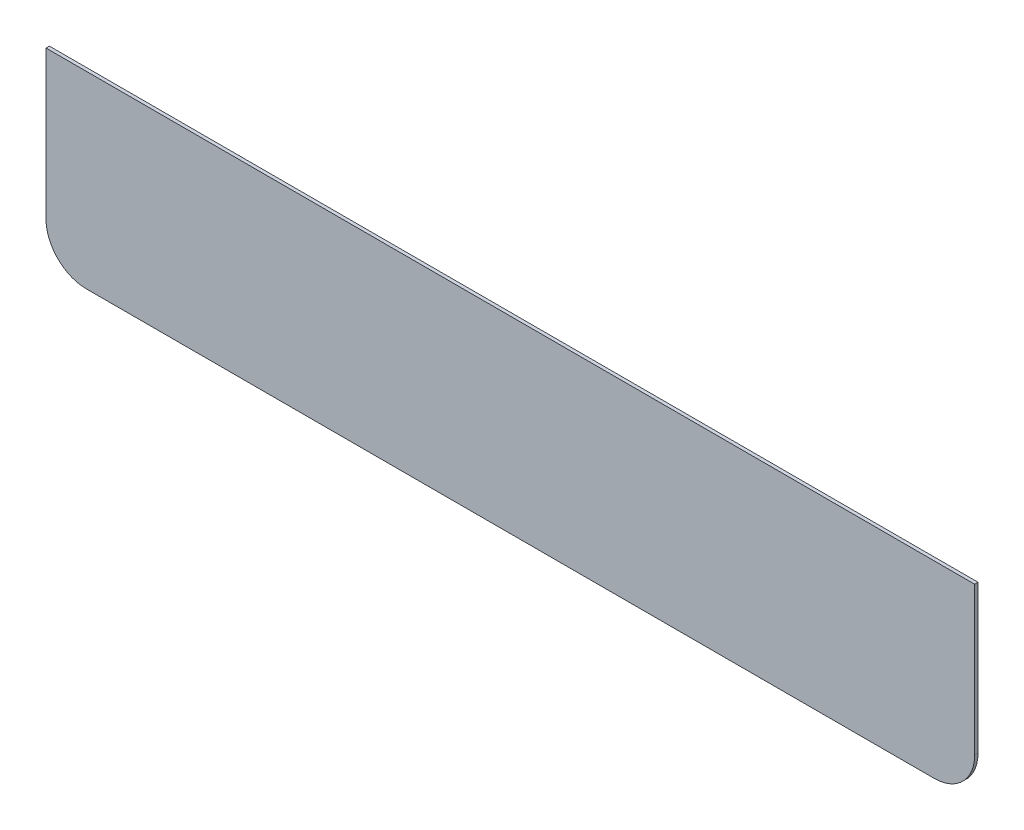
ISO-10303-21;
HEADER;
FILE_DESCRIPTION(('STEP AP214'),'2;1');
FILE_NAME('part.step','',(''),(''),'','','');
FILE_SCHEMA(('AUTOMOTIVE_DESIGN { 1 0 10303 214 1 1 1 1 }'));
ENDSEC;
DATA;
#1=APPLICATION_CONTEXT('core data for automotive mechanical design processes');
#2=APPLICATION_PROTOCOL_DEFINITION('international standard','automotive_design',2000,#1);
#3=PRODUCT_CONTEXT('',#1,'mechanical');
#4=PRODUCT('Part','Part','',(#3));
#5=PRODUCT_RELATED_PRODUCT_CATEGORY('part','',(#4));
#6=PRODUCT_DEFINITION_FORMATION('','',#4);
#7=PRODUCT_DEFINITION_CONTEXT('part definition',#1,'design');
#8=PRODUCT_DEFINITION('design','',#6,#7);
#9=PRODUCT_DEFINITION_SHAPE('','',#8);
#10=(LENGTH_UNIT() NAMED_UNIT(*) SI_UNIT(.MILLI.,.METRE.));
#11=(NAMED_UNIT(*) PLANE_ANGLE_UNIT() SI_UNIT($,.RADIAN.));
#12=(NAMED_UNIT(*) SI_UNIT($,.STERADIAN.) SOLID_ANGLE_UNIT());
#13=UNCERTAINTY_MEASURE_WITH_UNIT(LENGTH_MEASURE(1.E-05),#10,'distance_accuracy_value','');
#14=(GEOMETRIC_REPRESENTATION_CONTEXT(3) GLOBAL_UNCERTAINTY_ASSIGNED_CONTEXT((#13)) GLOBAL_UNIT_ASSIGNED_CONTEXT((#10,
#11,#12)) REPRESENTATION_CONTEXT('',''));
#15=CARTESIAN_POINT('',(0.,0.,0.));
#16=DIRECTION('',(0.,0.,1.));
#17=DIRECTION('',(1.,0.,0.));
#18=AXIS2_PLACEMENT_3D('',#15,#16,#17);
#19=CARTESIAN_POINT('',(839.453595320295,-154.88744171433,6.35));
#20=DIRECTION('',(0.,0.,1.));
#21=DIRECTION('',(1.,0.,0.));
#22=AXIS2_PLACEMENT_3D('',#19,#20,#21);
#23=PLANE('',#22);
#24=DIRECTION('',(0.,1.,0.));
#25=VECTOR('',#24,1.);
#26=CARTESIAN_POINT('',(-36.8464046797039,-259.54705830244,6.35));
#27=LINE('',#26,#25);
#28=CARTESIAN_POINT('',(-36.8464046797039,-259.54705830244,6.35));
#29=VERTEX_POINT('',#28);
#30=CARTESIAN_POINT('',(-36.8464046797039,19.8529416975601,6.35));
#31=VERTEX_POINT('',#30);
#32=EDGE_CURVE('E69',#29,#31,#27,.T.);
#33=ORIENTED_EDGE('',*,*,#32,.F.);
#34=CARTESIAN_POINT('',(39.3535953202961,-259.54705830244,6.35));
#35=DIRECTION('',(0.,0.,1.));
#36=DIRECTION('',(1.,0.,0.));
#37=AXIS2_PLACEMENT_3D('',#34,#35,#36);
#38=CIRCLE('',#37,76.2);
#39=CARTESIAN_POINT('',(39.3535953202961,-335.74705830244,6.35));
#40=VERTEX_POINT('',#39);
#41=EDGE_CURVE('E20',#40,#29,#38,.F.);
#42=ORIENTED_EDGE('',*,*,#41,.F.);
#43=DIRECTION('',(1.,0.,0.));
#44=VECTOR('',#43,1.);
#45=CARTESIAN_POINT('',(1639.55359532029,-335.74705830244,6.35));
#46=LINE('',#45,#44);
#47=CARTESIAN_POINT('',(1639.55359532029,-335.74705830244,6.35));
#48=VERTEX_POINT('',#47);
#49=EDGE_CURVE('E58',#48,#40,#46,.F.);
#50=ORIENTED_EDGE('',*,*,#49,.F.);
#51=CARTESIAN_POINT('',(1639.55359532029,-259.54705830244,6.35));
#52=DIRECTION('',(0.,0.,1.));
#53=DIRECTION('',(1.,0.,0.));
#54=AXIS2_PLACEMENT_3D('',#51,#52,#53);
#55=CIRCLE('',#54,76.2000000000002);
#56=CARTESIAN_POINT('',(1715.7535953203,-259.54705830244,6.35));
#57=VERTEX_POINT('',#56);
#58=EDGE_CURVE('E151',#57,#48,#55,.F.);
#59=ORIENTED_EDGE('',*,*,#58,.F.);
#60=DIRECTION('',(0.,1.,0.));
#61=VECTOR('',#60,1.);
#62=CARTESIAN_POINT('',(1715.7535953203,19.8529416975601,6.35));
#63=LINE('',#62,#61);
#64=CARTESIAN_POINT('',(1715.7535953203,19.8529416975601,6.35));
#65=VERTEX_POINT('',#64);
#66=EDGE_CURVE('E95',#65,#57,#63,.F.);
#67=ORIENTED_EDGE('',*,*,#66,.F.);
#68=DIRECTION('',(1.,0.,0.));
#69=VECTOR('',#68,1.);
#70=CARTESIAN_POINT('',(-36.8464046797039,19.8529416975601,6.35));
#71=LINE('',#70,#69);
#72=EDGE_CURVE('E93',#31,#65,#71,.T.);
#73=ORIENTED_EDGE('',*,*,#72,.F.);
#74=EDGE_LOOP('',(#33,#42,#50,#59,#67,#73));
#75=FACE_BOUND('',#74,.T.);
#76=ADVANCED_FACE('F17',(#75),#23,.T.);
#77=CARTESIAN_POINT('',(-36.8464046797039,19.8529416975601,0.));
#78=DIRECTION('',(0.,1.,0.));
#79=DIRECTION('',(0.,0.,1.));
#80=AXIS2_PLACEMENT_3D('',#77,#78,#79);
#81=PLANE('',#80);
#82=ORIENTED_EDGE('',*,*,#72,.T.);
#83=DIRECTION('',(0.,0.,-1.));
#84=VECTOR('',#83,1.);
#85=CARTESIAN_POINT('',(1715.7535953203,19.8529416975601,0.));
#86=LINE('',#85,#84);
#87=CARTESIAN_POINT('',(1715.7535953203,19.8529416975601,0.));
#88=VERTEX_POINT('',#87);
#89=EDGE_CURVE('E91',#88,#65,#86,.F.);
#90=ORIENTED_EDGE('',*,*,#89,.F.);
#91=DIRECTION('',(1.,0.,0.));
#92=VECTOR('',#91,1.);
#93=CARTESIAN_POINT('',(839.453595320295,19.8529416975601,0.));
#94=LINE('',#93,#92);
#95=CARTESIAN_POINT('',(-36.8464046797039,19.8529416975601,0.));
#96=VERTEX_POINT('',#95);
#97=EDGE_CURVE('E79',#88,#96,#94,.F.);
#98=ORIENTED_EDGE('',*,*,#97,.T.);
#99=DIRECTION('',(0.,0.,1.));
#100=VECTOR('',#99,1.);
#101=CARTESIAN_POINT('',(-36.8464046797039,19.8529416975601,0.));
#102=LINE('',#101,#100);
#103=EDGE_CURVE('E127',#31,#96,#102,.F.);
#104=ORIENTED_EDGE('',*,*,#103,.F.);
#105=EDGE_LOOP('',(#82,#90,#98,#104));
#106=FACE_BOUND('',#105,.T.);
#107=ADVANCED_FACE('F92',(#106),#81,.T.);
#108=CARTESIAN_POINT('',(-36.8464046797039,-259.54705830244,0.));
#109=DIRECTION('',(-1.,0.,0.));
#110=DIRECTION('',(0.,0.,1.));
#111=AXIS2_PLACEMENT_3D('',#108,#109,#110);
#112=PLANE('',#111);
#113=ORIENTED_EDGE('',*,*,#32,.T.);
#114=ORIENTED_EDGE('',*,*,#103,.T.);
#115=DIRECTION('',(0.,1.,0.));
#116=VECTOR('',#115,1.);
#117=CARTESIAN_POINT('',(-36.8464046797039,-154.88744171433,0.));
#118=LINE('',#117,#116);
#119=CARTESIAN_POINT('',(-36.8464046797039,-259.54705830244,0.));
#120=VERTEX_POINT('',#119);
#121=EDGE_CURVE('E86',#96,#120,#118,.F.);
#122=ORIENTED_EDGE('',*,*,#121,.T.);
#123=DIRECTION('',(0.,0.,1.));
#124=VECTOR('',#123,1.);
#125=CARTESIAN_POINT('',(-36.8464046797039,-259.54705830244,0.));
#126=LINE('',#125,#124);
#127=EDGE_CURVE('E129',#29,#120,#126,.F.);
#128=ORIENTED_EDGE('',*,*,#127,.F.);
#129=EDGE_LOOP('',(#113,#114,#122,#128));
#130=FACE_BOUND('',#129,.T.);
#131=ADVANCED_FACE('F118',(#130),#112,.T.);
#132=CARTESIAN_POINT('',(39.3535953202961,-259.54705830244,0.));
#133=DIRECTION('',(0.,0.,1.));
#134=DIRECTION('',(1.,0.,0.));
#135=AXIS2_PLACEMENT_3D('',#132,#133,#134);
#136=CYLINDRICAL_SURFACE('',#135,76.2);
#137=ORIENTED_EDGE('',*,*,#41,.T.);
#138=ORIENTED_EDGE('',*,*,#127,.T.);
#139=CARTESIAN_POINT('',(39.3535953202961,-259.54705830244,0.));
#140=DIRECTION('',(0.,0.,1.));
#141=DIRECTION('',(1.,0.,0.));
#142=AXIS2_PLACEMENT_3D('',#139,#140,#141);
#143=CIRCLE('',#142,76.2);
#144=CARTESIAN_POINT('',(39.3535953202961,-335.74705830244,0.));
#145=VERTEX_POINT('',#144);
#146=EDGE_CURVE('E150',#120,#145,#143,.T.);
#147=ORIENTED_EDGE('',*,*,#146,.T.);
#148=DIRECTION('',(0.,0.,-1.));
#149=VECTOR('',#148,1.);
#150=CARTESIAN_POINT('',(39.3535953202961,-335.74705830244,0.));
#151=LINE('',#150,#149);
#152=EDGE_CURVE('E132',#40,#145,#151,.T.);
#153=ORIENTED_EDGE('',*,*,#152,.F.);
#154=EDGE_LOOP('',(#137,#138,#147,#153));
#155=FACE_BOUND('',#154,.T.);
#156=ADVANCED_FACE('F115',(#155),#136,.T.);
#157=CARTESIAN_POINT('',(1639.55359532029,-335.74705830244,0.));
#158=DIRECTION('',(0.,-1.,0.));
#159=DIRECTION('',(0.,0.,-1.));
#160=AXIS2_PLACEMENT_3D('',#157,#158,#159);
#161=PLANE('',#160);
#162=ORIENTED_EDGE('',*,*,#49,.T.);
#163=ORIENTED_EDGE('',*,*,#152,.T.);
#164=DIRECTION('',(1.,0.,0.));
#165=VECTOR('',#164,1.);
#166=CARTESIAN_POINT('',(839.453595320295,-335.74705830244,0.));
#167=LINE('',#166,#165);
#168=CARTESIAN_POINT('',(1639.55359532029,-335.74705830244,0.));
#169=VERTEX_POINT('',#168);
#170=EDGE_CURVE('E149',#145,#169,#167,.T.);
#171=ORIENTED_EDGE('',*,*,#170,.T.);
#172=DIRECTION('',(0.,0.,1.));
#173=VECTOR('',#172,1.);
#174=CARTESIAN_POINT('',(1639.55359532029,-335.74705830244,0.));
#175=LINE('',#174,#173);
#176=EDGE_CURVE('E96',#48,#169,#175,.F.);
#177=ORIENTED_EDGE('',*,*,#176,.F.);
#178=EDGE_LOOP('',(#162,#163,#171,#177));
#179=FACE_BOUND('',#178,.T.);
#180=ADVANCED_FACE('F109',(#179),#161,.T.);
#181=CARTESIAN_POINT('',(1639.55359532029,-259.54705830244,0.));
#182=DIRECTION('',(0.,0.,1.));
#183=DIRECTION('',(1.,0.,0.));
#184=AXIS2_PLACEMENT_3D('',#181,#182,#183);
#185=CYLINDRICAL_SURFACE('',#184,76.2000000000002);
#186=ORIENTED_EDGE('',*,*,#58,.T.);
#187=ORIENTED_EDGE('',*,*,#176,.T.);
#188=CARTESIAN_POINT('',(1639.55359532029,-259.54705830244,0.));
#189=DIRECTION('',(0.,0.,1.));
#190=DIRECTION('',(1.,0.,0.));
#191=AXIS2_PLACEMENT_3D('',#188,#189,#190);
#192=CIRCLE('',#191,76.2000000000002);
#193=CARTESIAN_POINT('',(1715.7535953203,-259.54705830244,0.));
#194=VERTEX_POINT('',#193);
#195=EDGE_CURVE('E26',#169,#194,#192,.T.);
#196=ORIENTED_EDGE('',*,*,#195,.T.);
#197=DIRECTION('',(0.,0.,-1.));
#198=VECTOR('',#197,1.);
#199=CARTESIAN_POINT('',(1715.7535953203,-259.54705830244,0.));
#200=LINE('',#199,#198);
#201=EDGE_CURVE('E34',#57,#194,#200,.T.);
#202=ORIENTED_EDGE('',*,*,#201,.F.);
#203=EDGE_LOOP('',(#186,#187,#196,#202));
#204=FACE_BOUND('',#203,.T.);
#205=ADVANCED_FACE('F101',(#204),#185,.T.);
#206=CARTESIAN_POINT('',(1715.7535953203,19.8529416975601,0.));
#207=DIRECTION('',(1.,0.,0.));
#208=DIRECTION('',(0.,0.,-1.));
#209=AXIS2_PLACEMENT_3D('',#206,#207,#208);
#210=PLANE('',#209);
#211=ORIENTED_EDGE('',*,*,#66,.T.);
#212=ORIENTED_EDGE('',*,*,#201,.T.);
#213=DIRECTION('',(0.,1.,0.));
#214=VECTOR('',#213,1.);
#215=CARTESIAN_POINT('',(1715.7535953203,-154.88744171433,0.));
#216=LINE('',#215,#214);
#217=EDGE_CURVE('E11',#194,#88,#216,.T.);
#218=ORIENTED_EDGE('',*,*,#217,.T.);
#219=ORIENTED_EDGE('',*,*,#89,.T.);
#220=EDGE_LOOP('',(#211,#212,#218,#219));
#221=FACE_BOUND('',#220,.T.);
#222=ADVANCED_FACE('F98',(#221),#210,.T.);
#223=CARTESIAN_POINT('',(839.453595320295,-154.88744171433,0.));
#224=DIRECTION('',(0.,0.,1.));
#225=DIRECTION('',(1.,0.,0.));
#226=AXIS2_PLACEMENT_3D('',#223,#224,#225);
#227=PLANE('',#226);
#228=ORIENTED_EDGE('',*,*,#195,.F.);
#229=ORIENTED_EDGE('',*,*,#170,.F.);
#230=ORIENTED_EDGE('',*,*,#146,.F.);
#231=ORIENTED_EDGE('',*,*,#121,.F.);
#232=ORIENTED_EDGE('',*,*,#97,.F.);
#233=ORIENTED_EDGE('',*,*,#217,.F.);
#234=EDGE_LOOP('',(#228,#229,#230,#231,#232,#233));
#235=FACE_BOUND('',#234,.T.);
#236=ADVANCED_FACE('F82',(#235),#227,.F.);
#237=CLOSED_SHELL('',(#76,#107,#131,#156,#180,#205,#222,#236));
#238=MANIFOLD_SOLID_BREP('B1',#237);
#239=ADVANCED_BREP_SHAPE_REPRESENTATION('',(#18,#238),#14);
#240=SHAPE_DEFINITION_REPRESENTATION(#9,#239);
ENDSEC;
END-ISO-10303-21;
